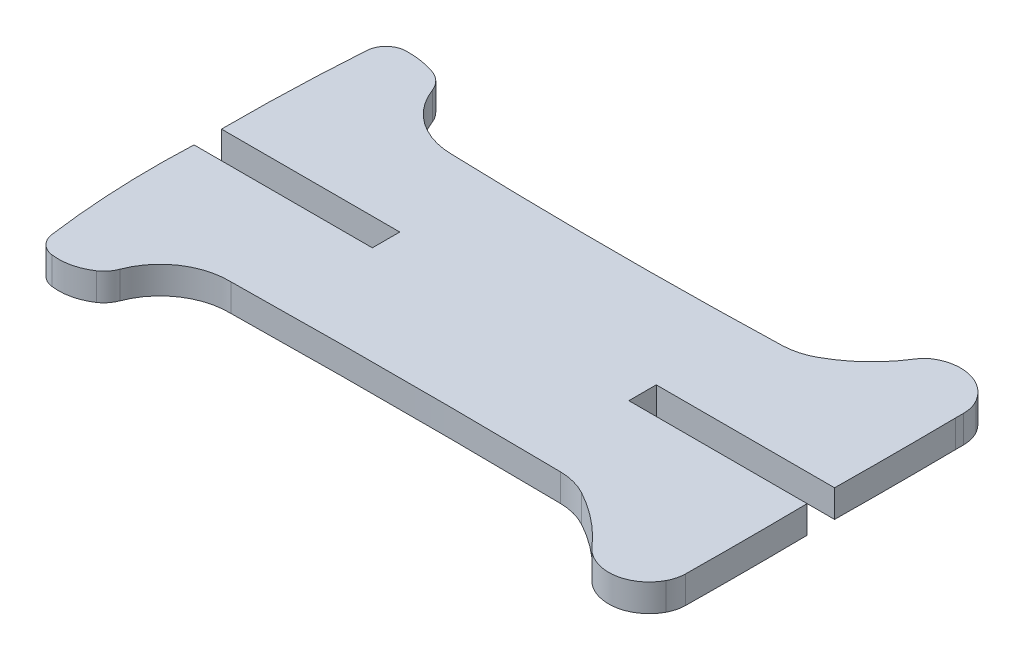
ISO-10303-21;
HEADER;
FILE_DESCRIPTION(('STEP AP214'),'2;1');
FILE_NAME('part.step','',(''),(''),'','','');
FILE_SCHEMA(('AUTOMOTIVE_DESIGN { 1 0 10303 214 1 1 1 1 }'));
ENDSEC;
DATA;
#1=APPLICATION_CONTEXT('core data for automotive mechanical design processes');
#2=APPLICATION_PROTOCOL_DEFINITION('international standard','automotive_design',2000,#1);
#3=PRODUCT_CONTEXT('',#1,'mechanical');
#4=PRODUCT('Part','Part','',(#3));
#5=PRODUCT_RELATED_PRODUCT_CATEGORY('part','',(#4));
#6=PRODUCT_DEFINITION_FORMATION('','',#4);
#7=PRODUCT_DEFINITION_CONTEXT('part definition',#1,'design');
#8=PRODUCT_DEFINITION('design','',#6,#7);
#9=PRODUCT_DEFINITION_SHAPE('','',#8);
#10=(LENGTH_UNIT() NAMED_UNIT(*) SI_UNIT(.MILLI.,.METRE.));
#11=(NAMED_UNIT(*) PLANE_ANGLE_UNIT() SI_UNIT($,.RADIAN.));
#12=(NAMED_UNIT(*) SI_UNIT($,.STERADIAN.) SOLID_ANGLE_UNIT());
#13=UNCERTAINTY_MEASURE_WITH_UNIT(LENGTH_MEASURE(1.E-05),#10,'distance_accuracy_value','');
#14=(GEOMETRIC_REPRESENTATION_CONTEXT(3) GLOBAL_UNCERTAINTY_ASSIGNED_CONTEXT((#13)) GLOBAL_UNIT_ASSIGNED_CONTEXT((#10,
#11,#12)) REPRESENTATION_CONTEXT('',''));
#15=CARTESIAN_POINT('',(0.,0.,0.));
#16=DIRECTION('',(0.,0.,1.));
#17=DIRECTION('',(1.,0.,0.));
#18=AXIS2_PLACEMENT_3D('',#15,#16,#17);
#19=CARTESIAN_POINT('',(224.331650718477,3.,-376.613762819195));
#20=DIRECTION('',(0.,-1.,0.));
#21=DIRECTION('',(0.,0.,-1.));
#22=AXIS2_PLACEMENT_3D('',#19,#20,#21);
#23=CYLINDRICAL_SURFACE('',#22,3.75000172829999);
#24=CARTESIAN_POINT('',(224.331650718477,0.,-376.613762819195));
#25=DIRECTION('',(0.,1.,0.));
#26=DIRECTION('',(0.,0.,1.));
#27=AXIS2_PLACEMENT_3D('',#24,#25,#26);
#28=CIRCLE('',#27,3.75000172829999);
#29=CARTESIAN_POINT('',(227.644000000028,0.,-374.855679999967));
#30=VERTEX_POINT('',#29);
#31=CARTESIAN_POINT('',(228.081419999959,0.,-376.572009999988));
#32=VERTEX_POINT('',#31);
#33=EDGE_CURVE('E261',#30,#32,#28,.T.);
#34=ORIENTED_EDGE('',*,*,#33,.T.);
#35=DIRECTION('',(0.,-1.,0.));
#36=VECTOR('',#35,1.);
#37=CARTESIAN_POINT('',(228.081419999959,3.,-376.572009999988));
#38=LINE('',#37,#36);
#39=CARTESIAN_POINT('',(228.081419999959,3.,-376.572009999988));
#40=VERTEX_POINT('',#39);
#41=EDGE_CURVE('E11',#40,#32,#38,.T.);
#42=ORIENTED_EDGE('',*,*,#41,.F.);
#43=CARTESIAN_POINT('',(224.331650718477,3.,-376.613762819195));
#44=DIRECTION('',(0.,1.,0.));
#45=DIRECTION('',(0.,0.,1.));
#46=AXIS2_PLACEMENT_3D('',#43,#44,#45);
#47=CIRCLE('',#46,3.75000172829999);
#48=CARTESIAN_POINT('',(227.644000000028,3.,-374.855679999967));
#49=VERTEX_POINT('',#48);
#50=EDGE_CURVE('E328',#49,#40,#47,.T.);
#51=ORIENTED_EDGE('',*,*,#50,.F.);
#52=DIRECTION('',(0.,-1.,0.));
#53=VECTOR('',#52,1.);
#54=CARTESIAN_POINT('',(227.644000000028,3.,-374.855679999967));
#55=LINE('',#54,#53);
#56=EDGE_CURVE('E257',#49,#30,#55,.T.);
#57=ORIENTED_EDGE('',*,*,#56,.T.);
#58=EDGE_LOOP('',(#34,#42,#51,#57));
#59=FACE_BOUND('',#58,.T.);
#60=ADVANCED_FACE('F34',(#59),#23,.T.);
#61=CARTESIAN_POINT('',(-346.105470004526,3.,-382.96579012445));
#62=DIRECTION('',(0.,-1.,0.));
#63=DIRECTION('',(0.,0.,-1.));
#64=AXIS2_PLACEMENT_3D('',#61,#62,#63);
#65=CYLINDRICAL_SURFACE('',#64,574.2224874361);
#66=CARTESIAN_POINT('',(-346.105470004526,0.,-382.96579012445));
#67=DIRECTION('',(0.,1.,0.));
#68=DIRECTION('',(0.,0.,1.));
#69=AXIS2_PLACEMENT_3D('',#66,#67,#68);
#70=CIRCLE('',#69,574.2224874361);
#71=CARTESIAN_POINT('',(228.075559999972,0.,-389.865779999461));
#72=VERTEX_POINT('',#71);
#73=EDGE_CURVE('E264',#32,#72,#70,.T.);
#74=ORIENTED_EDGE('',*,*,#73,.T.);
#75=DIRECTION('',(0.,-1.,0.));
#76=VECTOR('',#75,1.);
#77=CARTESIAN_POINT('',(228.075559999972,3.,-389.865779999461));
#78=LINE('',#77,#76);
#79=CARTESIAN_POINT('',(228.075559999972,3.,-389.865779999461));
#80=VERTEX_POINT('',#79);
#81=EDGE_CURVE('E42',#80,#72,#78,.T.);
#82=ORIENTED_EDGE('',*,*,#81,.F.);
#83=CARTESIAN_POINT('',(-346.105470004526,3.,-382.96579012445));
#84=DIRECTION('',(0.,1.,0.));
#85=DIRECTION('',(0.,0.,1.));
#86=AXIS2_PLACEMENT_3D('',#83,#84,#85);
#87=CIRCLE('',#86,574.2224874361);
#88=EDGE_CURVE('E155',#40,#80,#87,.T.);
#89=ORIENTED_EDGE('',*,*,#88,.F.);
#90=ORIENTED_EDGE('',*,*,#41,.T.);
#91=EDGE_LOOP('',(#74,#82,#89,#90));
#92=FACE_BOUND('',#91,.T.);
#93=ADVANCED_FACE('F488',(#92),#65,.T.);
#94=CARTESIAN_POINT('',(-288.964779950811,3.,-389.865779999461));
#95=DIRECTION('',(0.,0.,1.));
#96=DIRECTION('',(1.,0.,0.));
#97=AXIS2_PLACEMENT_3D('',#94,#95,#96);
#98=PLANE('',#97);
#99=DIRECTION('',(-1.,0.,0.));
#100=VECTOR('',#99,1.);
#101=CARTESIAN_POINT('',(-288.964779950811,0.,-389.865779999461));
#102=LINE('',#101,#100);
#103=CARTESIAN_POINT('',(208.575559999979,0.,-389.865779999461));
#104=VERTEX_POINT('',#103);
#105=EDGE_CURVE('E266',#72,#104,#102,.T.);
#106=ORIENTED_EDGE('',*,*,#105,.T.);
#107=DIRECTION('',(0.,-1.,0.));
#108=VECTOR('',#107,1.);
#109=CARTESIAN_POINT('',(208.575559999979,3.,-389.865779999461));
#110=LINE('',#109,#108);
#111=CARTESIAN_POINT('',(208.575559999979,3.,-389.865779999461));
#112=VERTEX_POINT('',#111);
#113=EDGE_CURVE('E394',#112,#104,#110,.T.);
#114=ORIENTED_EDGE('',*,*,#113,.F.);
#115=DIRECTION('',(-1.,0.,0.));
#116=VECTOR('',#115,1.);
#117=CARTESIAN_POINT('',(-288.964779950811,3.,-389.865779999461));
#118=LINE('',#117,#116);
#119=EDGE_CURVE('E402',#80,#112,#118,.T.);
#120=ORIENTED_EDGE('',*,*,#119,.F.);
#121=ORIENTED_EDGE('',*,*,#81,.T.);
#122=EDGE_LOOP('',(#106,#114,#120,#121));
#123=FACE_BOUND('',#122,.T.);
#124=ADVANCED_FACE('F400',(#123),#98,.F.);
#125=CARTESIAN_POINT('',(208.575560000121,3.,-409.999999996478));
#126=DIRECTION('',(-1.,0.,-7.07767178071345E-12));
#127=DIRECTION('',(-7.07767178071345E-12,0.,1.));
#128=AXIS2_PLACEMENT_3D('',#125,#126,#127);
#129=PLANE('',#128);
#130=DIRECTION('',(7.07767178071345E-12,0.,-1.));
#131=VECTOR('',#130,1.);
#132=CARTESIAN_POINT('',(208.575560000121,0.,-409.999999996478));
#133=LINE('',#132,#131);
#134=CARTESIAN_POINT('',(208.57556,0.,-392.86578));
#135=VERTEX_POINT('',#134);
#136=EDGE_CURVE('E268',#104,#135,#133,.T.);
#137=ORIENTED_EDGE('',*,*,#136,.T.);
#138=DIRECTION('',(0.,-1.,0.));
#139=VECTOR('',#138,1.);
#140=CARTESIAN_POINT('',(208.57556,3.,-392.86578));
#141=LINE('',#140,#139);
#142=CARTESIAN_POINT('',(208.57556,3.,-392.86578));
#143=VERTEX_POINT('',#142);
#144=EDGE_CURVE('E391',#143,#135,#141,.T.);
#145=ORIENTED_EDGE('',*,*,#144,.F.);
#146=DIRECTION('',(7.07767178071345E-12,0.,-1.));
#147=VECTOR('',#146,1.);
#148=CARTESIAN_POINT('',(208.575560000121,3.,-409.999999996478));
#149=LINE('',#148,#147);
#150=EDGE_CURVE('E420',#112,#143,#149,.T.);
#151=ORIENTED_EDGE('',*,*,#150,.F.);
#152=ORIENTED_EDGE('',*,*,#113,.T.);
#153=EDGE_LOOP('',(#137,#145,#151,#152));
#154=FACE_BOUND('',#153,.T.);
#155=ADVANCED_FACE('F411',(#154),#129,.F.);
#156=CARTESIAN_POINT('',(-288.964779950811,3.,-392.86578));
#157=DIRECTION('',(0.,0.,-1.));
#158=DIRECTION('',(-1.,0.,0.));
#159=AXIS2_PLACEMENT_3D('',#156,#157,#158);
#160=PLANE('',#159);
#161=DIRECTION('',(1.,0.,0.));
#162=VECTOR('',#161,1.);
#163=CARTESIAN_POINT('',(-288.964779950811,0.,-392.86578));
#164=LINE('',#163,#162);
#165=CARTESIAN_POINT('',(228.075559999956,0.,-392.86578));
#166=VERTEX_POINT('',#165);
#167=EDGE_CURVE('E270',#135,#166,#164,.T.);
#168=ORIENTED_EDGE('',*,*,#167,.T.);
#169=DIRECTION('',(0.,-1.,0.));
#170=VECTOR('',#169,1.);
#171=CARTESIAN_POINT('',(228.075559999956,3.,-392.86578));
#172=LINE('',#171,#170);
#173=CARTESIAN_POINT('',(228.075559999956,3.,-392.86578));
#174=VERTEX_POINT('',#173);
#175=EDGE_CURVE('E388',#174,#166,#172,.T.);
#176=ORIENTED_EDGE('',*,*,#175,.F.);
#177=DIRECTION('',(1.,0.,0.));
#178=VECTOR('',#177,1.);
#179=CARTESIAN_POINT('',(-288.964779950811,3.,-392.86578));
#180=LINE('',#179,#178);
#181=EDGE_CURVE('E417',#143,#174,#180,.T.);
#182=ORIENTED_EDGE('',*,*,#181,.F.);
#183=ORIENTED_EDGE('',*,*,#144,.T.);
#184=EDGE_LOOP('',(#168,#176,#182,#183));
#185=FACE_BOUND('',#184,.T.);
#186=ADVANCED_FACE('F415',(#185),#160,.F.);
#187=CARTESIAN_POINT('',(-374.417780000065,3.,-399.465780001946));
#188=DIRECTION('',(0.,-1.,0.));
#189=DIRECTION('',(0.,0.,-1.));
#190=AXIS2_PLACEMENT_3D('',#187,#188,#189);
#191=CYLINDRICAL_SURFACE('',#190,602.5294886928);
#192=CARTESIAN_POINT('',(-374.417780000065,0.,-399.465780001946));
#193=DIRECTION('',(0.,1.,0.));
#194=DIRECTION('',(0.,0.,1.));
#195=AXIS2_PLACEMENT_3D('',#192,#193,#194);
#196=CIRCLE('',#195,602.5294886928);
#197=CARTESIAN_POINT('',(228.07556,0.,-406.065779999915));
#198=VERTEX_POINT('',#197);
#199=EDGE_CURVE('E272',#166,#198,#196,.T.);
#200=ORIENTED_EDGE('',*,*,#199,.T.);
#201=DIRECTION('',(0.,-1.,0.));
#202=VECTOR('',#201,1.);
#203=CARTESIAN_POINT('',(228.07556,3.,-406.065779999915));
#204=LINE('',#203,#202);
#205=CARTESIAN_POINT('',(228.07556,3.,-406.065779999915));
#206=VERTEX_POINT('',#205);
#207=EDGE_CURVE('E385',#206,#198,#204,.T.);
#208=ORIENTED_EDGE('',*,*,#207,.F.);
#209=CARTESIAN_POINT('',(-374.417780000065,3.,-399.465780001946));
#210=DIRECTION('',(0.,1.,0.));
#211=DIRECTION('',(0.,0.,1.));
#212=AXIS2_PLACEMENT_3D('',#209,#210,#211);
#213=CIRCLE('',#212,602.5294886928);
#214=EDGE_CURVE('E419',#174,#206,#213,.T.);
#215=ORIENTED_EDGE('',*,*,#214,.F.);
#216=ORIENTED_EDGE('',*,*,#175,.T.);
#217=EDGE_LOOP('',(#200,#208,#215,#216));
#218=FACE_BOUND('',#217,.T.);
#219=ADVANCED_FACE('F501',(#218),#191,.T.);
#220=CARTESIAN_POINT('',(228.07556,3.,-410.));
#221=DIRECTION('',(-1.,0.,0.));
#222=DIRECTION('',(0.,0.,1.));
#223=AXIS2_PLACEMENT_3D('',#220,#221,#222);
#224=PLANE('',#223);
#225=DIRECTION('',(0.,0.,-1.));
#226=VECTOR('',#225,1.);
#227=CARTESIAN_POINT('',(228.07556,0.,-410.));
#228=LINE('',#227,#226);
#229=CARTESIAN_POINT('',(228.07556,0.,-406.9652));
#230=VERTEX_POINT('',#229);
#231=EDGE_CURVE('E274',#198,#230,#228,.T.);
#232=ORIENTED_EDGE('',*,*,#231,.T.);
#233=DIRECTION('',(0.,-1.,0.));
#234=VECTOR('',#233,1.);
#235=CARTESIAN_POINT('',(228.07556,3.,-406.9652));
#236=LINE('',#235,#234);
#237=CARTESIAN_POINT('',(228.07556,3.,-406.9652));
#238=VERTEX_POINT('',#237);
#239=EDGE_CURVE('E382',#238,#230,#236,.T.);
#240=ORIENTED_EDGE('',*,*,#239,.F.);
#241=DIRECTION('',(0.,0.,-1.));
#242=VECTOR('',#241,1.);
#243=CARTESIAN_POINT('',(228.07556,3.,-410.));
#244=LINE('',#243,#242);
#245=EDGE_CURVE('E422',#206,#238,#244,.T.);
#246=ORIENTED_EDGE('',*,*,#245,.F.);
#247=ORIENTED_EDGE('',*,*,#207,.T.);
#248=EDGE_LOOP('',(#232,#240,#246,#247));
#249=FACE_BOUND('',#248,.T.);
#250=ADVANCED_FACE('F504',(#249),#224,.F.);
#251=CARTESIAN_POINT('',(224.325562279609,3.,-406.965191728485));
#252=DIRECTION('',(0.,-1.,0.));
#253=DIRECTION('',(0.,0.,-1.));
#254=AXIS2_PLACEMENT_3D('',#251,#252,#253);
#255=CYLINDRICAL_SURFACE('',#254,3.74999772039999);
#256=CARTESIAN_POINT('',(224.325562279609,0.,-406.965191728485));
#257=DIRECTION('',(0.,1.,0.));
#258=DIRECTION('',(0.,0.,1.));
#259=AXIS2_PLACEMENT_3D('',#256,#257,#258);
#260=CIRCLE('',#259,3.74999772039999);
#261=CARTESIAN_POINT('',(227.546129999995,0.,-408.886239999979));
#262=VERTEX_POINT('',#261);
#263=EDGE_CURVE('E276',#230,#262,#260,.T.);
#264=ORIENTED_EDGE('',*,*,#263,.T.);
#265=DIRECTION('',(0.,-1.,0.));
#266=VECTOR('',#265,1.);
#267=CARTESIAN_POINT('',(227.546129999995,3.,-408.886239999979));
#268=LINE('',#267,#266);
#269=CARTESIAN_POINT('',(227.546129999995,3.,-408.886239999979));
#270=VERTEX_POINT('',#269);
#271=EDGE_CURVE('E379',#270,#262,#268,.T.);
#272=ORIENTED_EDGE('',*,*,#271,.F.);
#273=CARTESIAN_POINT('',(224.325562279609,3.,-406.965191728485));
#274=DIRECTION('',(0.,1.,0.));
#275=DIRECTION('',(0.,0.,1.));
#276=AXIS2_PLACEMENT_3D('',#273,#274,#275);
#277=CIRCLE('',#276,3.74999772039999);
#278=EDGE_CURVE('E428',#238,#270,#277,.T.);
#279=ORIENTED_EDGE('',*,*,#278,.F.);
#280=ORIENTED_EDGE('',*,*,#239,.T.);
#281=EDGE_LOOP('',(#264,#272,#279,#280));
#282=FACE_BOUND('',#281,.T.);
#283=ADVANCED_FACE('F508',(#282),#255,.T.);
#284=CARTESIAN_POINT('',(223.627115951546,3.,-406.548581034668));
#285=DIRECTION('',(0.,-1.,0.));
#286=DIRECTION('',(0.,0.,-1.));
#287=AXIS2_PLACEMENT_3D('',#284,#285,#286);
#288=CYLINDRICAL_SURFACE('',#287,4.56325766860001);
#289=CARTESIAN_POINT('',(223.627115951546,0.,-406.548581034668));
#290=DIRECTION('',(0.,1.,0.));
#291=DIRECTION('',(0.,0.,1.));
#292=AXIS2_PLACEMENT_3D('',#289,#290,#291);
#293=CIRCLE('',#292,4.56325766860001);
#294=CARTESIAN_POINT('',(221.31038000003,0.,-410.480000000003));
#295=VERTEX_POINT('',#294);
#296=EDGE_CURVE('E278',#262,#295,#293,.T.);
#297=ORIENTED_EDGE('',*,*,#296,.T.);
#298=DIRECTION('',(0.,-1.,0.));
#299=VECTOR('',#298,1.);
#300=CARTESIAN_POINT('',(221.31038000003,3.,-410.480000000003));
#301=LINE('',#300,#299);
#302=CARTESIAN_POINT('',(221.31038000003,3.,-410.480000000003));
#303=VERTEX_POINT('',#302);
#304=EDGE_CURVE('E376',#303,#295,#301,.T.);
#305=ORIENTED_EDGE('',*,*,#304,.F.);
#306=CARTESIAN_POINT('',(223.627115951546,3.,-406.548581034668));
#307=DIRECTION('',(0.,1.,0.));
#308=DIRECTION('',(0.,0.,1.));
#309=AXIS2_PLACEMENT_3D('',#306,#307,#308);
#310=CIRCLE('',#309,4.56325766860001);
#311=EDGE_CURVE('E430',#270,#303,#310,.T.);
#312=ORIENTED_EDGE('',*,*,#311,.F.);
#313=ORIENTED_EDGE('',*,*,#271,.T.);
#314=EDGE_LOOP('',(#297,#305,#312,#313));
#315=FACE_BOUND('',#314,.T.);
#316=ADVANCED_FACE('F512',(#315),#288,.T.);
#317=CARTESIAN_POINT('',(222.833473394324,3.,-407.895383308238));
#318=DIRECTION('',(0.,-1.,0.));
#319=DIRECTION('',(0.,0.,-1.));
#320=AXIS2_PLACEMENT_3D('',#317,#318,#319);
#321=CYLINDRICAL_SURFACE('',#320,3.00000948849998);
#322=CARTESIAN_POINT('',(222.833473394324,0.,-407.895383308238));
#323=DIRECTION('',(0.,1.,0.));
#324=DIRECTION('',(0.,0.,1.));
#325=AXIS2_PLACEMENT_3D('',#322,#323,#324);
#326=CIRCLE('',#325,3.00000948849998);
#327=CARTESIAN_POINT('',(220.288830000009,0.,-409.484359999968));
#328=VERTEX_POINT('',#327);
#329=EDGE_CURVE('E280',#295,#328,#326,.T.);
#330=ORIENTED_EDGE('',*,*,#329,.T.);
#331=DIRECTION('',(0.,-1.,0.));
#332=VECTOR('',#331,1.);
#333=CARTESIAN_POINT('',(220.288830000009,3.,-409.484359999968));
#334=LINE('',#333,#332);
#335=CARTESIAN_POINT('',(220.288830000009,3.,-409.484359999968));
#336=VERTEX_POINT('',#335);
#337=EDGE_CURVE('E374',#336,#328,#334,.T.);
#338=ORIENTED_EDGE('',*,*,#337,.F.);
#339=CARTESIAN_POINT('',(222.833473394324,3.,-407.895383308238));
#340=DIRECTION('',(0.,1.,0.));
#341=DIRECTION('',(0.,0.,1.));
#342=AXIS2_PLACEMENT_3D('',#339,#340,#341);
#343=CIRCLE('',#342,3.00000948849998);
#344=EDGE_CURVE('E432',#303,#336,#343,.T.);
#345=ORIENTED_EDGE('',*,*,#344,.F.);
#346=ORIENTED_EDGE('',*,*,#304,.T.);
#347=EDGE_LOOP('',(#330,#338,#345,#346));
#348=FACE_BOUND('',#347,.T.);
#349=ADVANCED_FACE('F516',(#348),#321,.T.);
#350=CARTESIAN_POINT('',(207.647242515142,3.,-417.378262933308));
#351=DIRECTION('',(0.,-1.,0.));
#352=DIRECTION('',(0.,0.,-1.));
#353=AXIS2_PLACEMENT_3D('',#350,#351,#352);
#354=CYLINDRICAL_SURFACE('',#353,14.9038061467019);
#355=CARTESIAN_POINT('',(207.647242515142,0.,-417.378262933308));
#356=DIRECTION('',(0.,1.,0.));
#357=DIRECTION('',(0.,0.,1.));
#358=AXIS2_PLACEMENT_3D('',#355,#356,#357);
#359=CIRCLE('',#358,14.9038061467019);
#360=CARTESIAN_POINT('',(214.802050000057,0.,-404.304159999941));
#361=VERTEX_POINT('',#360);
#362=EDGE_CURVE('E283',#361,#328,#359,.T.);
#363=ORIENTED_EDGE('',*,*,#362,.F.);
#364=DIRECTION('',(0.,-1.,0.));
#365=VECTOR('',#364,1.);
#366=CARTESIAN_POINT('',(214.802050000057,3.,-404.304159999941));
#367=LINE('',#366,#365);
#368=CARTESIAN_POINT('',(214.802050000057,3.,-404.304159999941));
#369=VERTEX_POINT('',#368);
#370=EDGE_CURVE('E372',#369,#361,#367,.T.);
#371=ORIENTED_EDGE('',*,*,#370,.F.);
#372=CARTESIAN_POINT('',(207.647242515142,3.,-417.378262933308));
#373=DIRECTION('',(0.,1.,0.));
#374=DIRECTION('',(0.,0.,1.));
#375=AXIS2_PLACEMENT_3D('',#372,#373,#374);
#376=CIRCLE('',#375,14.9038061467019);
#377=EDGE_CURVE('E434',#369,#336,#376,.T.);
#378=ORIENTED_EDGE('',*,*,#377,.T.);
#379=ORIENTED_EDGE('',*,*,#337,.T.);
#380=EDGE_LOOP('',(#363,#371,#378,#379));
#381=FACE_BOUND('',#380,.T.);
#382=ADVANCED_FACE('F520',(#381),#354,.F.);
#383=CARTESIAN_POINT('',(211.561597945263,3.,-410.225476723589));
#384=DIRECTION('',(0.,-1.,0.));
#385=DIRECTION('',(0.,0.,-1.));
#386=AXIS2_PLACEMENT_3D('',#383,#384,#385);
#387=CYLINDRICAL_SURFACE('',#386,6.75000157489995);
#388=CARTESIAN_POINT('',(211.561597945263,0.,-410.225476723589));
#389=DIRECTION('',(0.,1.,0.));
#390=DIRECTION('',(0.,0.,1.));
#391=AXIS2_PLACEMENT_3D('',#388,#389,#390);
#392=CIRCLE('',#391,6.75000157489995);
#393=CARTESIAN_POINT('',(211.764320000067,0.,-403.478520000025));
#394=VERTEX_POINT('',#393);
#395=EDGE_CURVE('E286',#394,#361,#392,.T.);
#396=ORIENTED_EDGE('',*,*,#395,.F.);
#397=DIRECTION('',(0.,-1.,0.));
#398=VECTOR('',#397,1.);
#399=CARTESIAN_POINT('',(211.764320000067,3.,-403.478520000025));
#400=LINE('',#399,#398);
#401=CARTESIAN_POINT('',(211.764320000067,3.,-403.478520000025));
#402=VERTEX_POINT('',#401);
#403=EDGE_CURVE('E370',#402,#394,#400,.T.);
#404=ORIENTED_EDGE('',*,*,#403,.F.);
#405=CARTESIAN_POINT('',(211.561597945263,3.,-410.225476723589));
#406=DIRECTION('',(0.,1.,0.));
#407=DIRECTION('',(0.,0.,1.));
#408=AXIS2_PLACEMENT_3D('',#405,#406,#407);
#409=CIRCLE('',#408,6.75000157489995);
#410=EDGE_CURVE('E437',#402,#369,#409,.T.);
#411=ORIENTED_EDGE('',*,*,#410,.T.);
#412=ORIENTED_EDGE('',*,*,#370,.T.);
#413=EDGE_LOOP('',(#396,#404,#411,#412));
#414=FACE_BOUND('',#413,.T.);
#415=ADVANCED_FACE('F524',(#414),#387,.F.);
#416=CARTESIAN_POINT('',(194.269467053019,3.,-985.787559838271));
#417=DIRECTION('',(0.,-1.,0.));
#418=DIRECTION('',(0.,0.,-1.));
#419=AXIS2_PLACEMENT_3D('',#416,#417,#418);
#420=CYLINDRICAL_SURFACE('',#419,582.5717876425);
#421=CARTESIAN_POINT('',(194.269467053019,0.,-985.787559838271));
#422=DIRECTION('',(0.,1.,0.));
#423=DIRECTION('',(0.,0.,1.));
#424=AXIS2_PLACEMENT_3D('',#421,#422,#423);
#425=CIRCLE('',#424,582.5717876425);
#426=CARTESIAN_POINT('',(175.575560000055,0.,-403.515779999961));
#427=VERTEX_POINT('',#426);
#428=EDGE_CURVE('E289',#427,#394,#425,.T.);
#429=ORIENTED_EDGE('',*,*,#428,.F.);
#430=DIRECTION('',(0.,-1.,0.));
#431=VECTOR('',#430,1.);
#432=CARTESIAN_POINT('',(175.575560000055,3.,-403.515779999961));
#433=LINE('',#432,#431);
#434=CARTESIAN_POINT('',(175.575560000055,3.,-403.515779999961));
#435=VERTEX_POINT('',#434);
#436=EDGE_CURVE('E368',#435,#427,#433,.T.);
#437=ORIENTED_EDGE('',*,*,#436,.F.);
#438=CARTESIAN_POINT('',(194.269467053019,3.,-985.787559838271));
#439=DIRECTION('',(0.,1.,0.));
#440=DIRECTION('',(0.,0.,1.));
#441=AXIS2_PLACEMENT_3D('',#438,#439,#440);
#442=CIRCLE('',#441,582.5717876425);
#443=EDGE_CURVE('E440',#435,#402,#442,.T.);
#444=ORIENTED_EDGE('',*,*,#443,.T.);
#445=ORIENTED_EDGE('',*,*,#403,.T.);
#446=EDGE_LOOP('',(#429,#437,#444,#445));
#447=FACE_BOUND('',#446,.T.);
#448=ADVANCED_FACE('F528',(#447),#420,.F.);
#449=CARTESIAN_POINT('',(175.619236054,3.,-411.1794327584));
#450=DIRECTION('',(0.,-1.,0.));
#451=DIRECTION('',(0.,0.,-1.));
#452=AXIS2_PLACEMENT_3D('',#449,#450,#451);
#453=CYLINDRICAL_SURFACE('',#452,7.66377721490017);
#454=CARTESIAN_POINT('',(175.619236054,0.,-411.1794327584));
#455=DIRECTION('',(0.,1.,0.));
#456=DIRECTION('',(0.,0.,1.));
#457=AXIS2_PLACEMENT_3D('',#454,#455,#456);
#458=CIRCLE('',#457,7.66377721490017);
#459=CARTESIAN_POINT('',(168.436880000052,0.,-408.505999999953));
#460=VERTEX_POINT('',#459);
#461=EDGE_CURVE('E292',#460,#427,#458,.T.);
#462=ORIENTED_EDGE('',*,*,#461,.F.);
#463=DIRECTION('',(0.,-1.,0.));
#464=VECTOR('',#463,1.);
#465=CARTESIAN_POINT('',(168.436880000052,3.,-408.505999999953));
#466=LINE('',#465,#464);
#467=CARTESIAN_POINT('',(168.436880000052,3.,-408.505999999953));
#468=VERTEX_POINT('',#467);
#469=EDGE_CURVE('E366',#468,#460,#466,.T.);
#470=ORIENTED_EDGE('',*,*,#469,.F.);
#471=CARTESIAN_POINT('',(175.619236054,3.,-411.1794327584));
#472=DIRECTION('',(0.,1.,0.));
#473=DIRECTION('',(0.,0.,1.));
#474=AXIS2_PLACEMENT_3D('',#471,#472,#473);
#475=CIRCLE('',#474,7.66377721490017);
#476=EDGE_CURVE('E443',#468,#435,#475,.T.);
#477=ORIENTED_EDGE('',*,*,#476,.T.);
#478=ORIENTED_EDGE('',*,*,#436,.T.);
#479=EDGE_LOOP('',(#462,#470,#477,#478));
#480=FACE_BOUND('',#479,.T.);
#481=ADVANCED_FACE('F532',(#480),#453,.F.);
#482=CARTESIAN_POINT('',(165.625334652336,3.,-407.459475483788));
#483=DIRECTION('',(0.,-1.,0.));
#484=DIRECTION('',(0.,0.,-1.));
#485=AXIS2_PLACEMENT_3D('',#482,#483,#484);
#486=CYLINDRICAL_SURFACE('',#485,3.00000013419999);
#487=CARTESIAN_POINT('',(165.625334652336,0.,-407.459475483788));
#488=DIRECTION('',(0.,1.,0.));
#489=DIRECTION('',(0.,0.,1.));
#490=AXIS2_PLACEMENT_3D('',#487,#488,#489);
#491=CIRCLE('',#490,3.00000013419999);
#492=CARTESIAN_POINT('',(166.587990000024,0.,-410.300829999994));
#493=VERTEX_POINT('',#492);
#494=EDGE_CURVE('E295',#460,#493,#491,.T.);
#495=ORIENTED_EDGE('',*,*,#494,.T.);
#496=DIRECTION('',(0.,-1.,0.));
#497=VECTOR('',#496,1.);
#498=CARTESIAN_POINT('',(166.587990000024,3.,-410.300829999994));
#499=LINE('',#498,#497);
#500=CARTESIAN_POINT('',(166.587990000024,3.,-410.300829999994));
#501=VERTEX_POINT('',#500);
#502=EDGE_CURVE('E363',#501,#493,#499,.T.);
#503=ORIENTED_EDGE('',*,*,#502,.F.);
#504=CARTESIAN_POINT('',(165.625334652336,3.,-407.459475483788));
#505=DIRECTION('',(0.,1.,0.));
#506=DIRECTION('',(0.,0.,1.));
#507=AXIS2_PLACEMENT_3D('',#504,#505,#506);
#508=CIRCLE('',#507,3.00000013419999);
#509=EDGE_CURVE('E446',#468,#501,#508,.T.);
#510=ORIENTED_EDGE('',*,*,#509,.F.);
#511=ORIENTED_EDGE('',*,*,#469,.T.);
#512=EDGE_LOOP('',(#495,#503,#510,#511));
#513=FACE_BOUND('',#512,.T.);
#514=ADVANCED_FACE('F536',(#513),#486,.T.);
#515=CARTESIAN_POINT('',(163.499598864966,3.,-401.185241701902));
#516=DIRECTION('',(0.,-1.,0.));
#517=DIRECTION('',(0.,0.,-1.));
#518=AXIS2_PLACEMENT_3D('',#515,#516,#517);
#519=CYLINDRICAL_SURFACE('',#518,9.624557643);
#520=CARTESIAN_POINT('',(163.499598864966,0.,-401.185241701902));
#521=DIRECTION('',(0.,1.,0.));
#522=DIRECTION('',(0.,0.,1.));
#523=AXIS2_PLACEMENT_3D('',#520,#521,#522);
#524=CIRCLE('',#523,9.624557643);
#525=CARTESIAN_POINT('',(163.275069999974,0.,-410.80717999999));
#526=VERTEX_POINT('',#525);
#527=EDGE_CURVE('E297',#493,#526,#524,.T.);
#528=ORIENTED_EDGE('',*,*,#527,.T.);
#529=DIRECTION('',(0.,-1.,0.));
#530=VECTOR('',#529,1.);
#531=CARTESIAN_POINT('',(163.275069999974,3.,-410.80717999999));
#532=LINE('',#531,#530);
#533=CARTESIAN_POINT('',(163.275069999974,3.,-410.80717999999));
#534=VERTEX_POINT('',#533);
#535=EDGE_CURVE('E360',#534,#526,#532,.T.);
#536=ORIENTED_EDGE('',*,*,#535,.F.);
#537=CARTESIAN_POINT('',(163.499598864966,3.,-401.185241701902));
#538=DIRECTION('',(0.,1.,0.));
#539=DIRECTION('',(0.,0.,1.));
#540=AXIS2_PLACEMENT_3D('',#537,#538,#539);
#541=CIRCLE('',#540,9.624557643);
#542=EDGE_CURVE('E448',#501,#534,#541,.T.);
#543=ORIENTED_EDGE('',*,*,#542,.F.);
#544=ORIENTED_EDGE('',*,*,#502,.T.);
#545=EDGE_LOOP('',(#528,#536,#543,#544));
#546=FACE_BOUND('',#545,.T.);
#547=ADVANCED_FACE('F540',(#546),#519,.T.);
#548=CARTESIAN_POINT('',(163.327560555405,3.,-408.557790530468));
#549=DIRECTION('',(0.,-1.,0.));
#550=DIRECTION('',(0.,0.,-1.));
#551=AXIS2_PLACEMENT_3D('',#548,#549,#550);
#552=CYLINDRICAL_SURFACE('',#551,2.25000183199998);
#553=CARTESIAN_POINT('',(163.327560555405,0.,-408.557790530468));
#554=DIRECTION('',(0.,1.,0.));
#555=DIRECTION('',(0.,0.,1.));
#556=AXIS2_PLACEMENT_3D('',#553,#554,#555);
#557=CIRCLE('',#556,2.25000183199998);
#558=CARTESIAN_POINT('',(161.082960000022,0.,-408.713599999951));
#559=VERTEX_POINT('',#558);
#560=EDGE_CURVE('E299',#526,#559,#557,.T.);
#561=ORIENTED_EDGE('',*,*,#560,.T.);
#562=DIRECTION('',(0.,-1.,0.));
#563=VECTOR('',#562,1.);
#564=CARTESIAN_POINT('',(161.082960000022,3.,-408.713599999951));
#565=LINE('',#564,#563);
#566=CARTESIAN_POINT('',(161.082960000022,3.,-408.713599999951));
#567=VERTEX_POINT('',#566);
#568=EDGE_CURVE('E357',#567,#559,#565,.T.);
#569=ORIENTED_EDGE('',*,*,#568,.F.);
#570=CARTESIAN_POINT('',(163.327560555405,3.,-408.557790530468));
#571=DIRECTION('',(0.,1.,0.));
#572=DIRECTION('',(0.,0.,1.));
#573=AXIS2_PLACEMENT_3D('',#570,#571,#572);
#574=CIRCLE('',#573,2.25000183199998);
#575=EDGE_CURVE('E450',#534,#567,#574,.T.);
#576=ORIENTED_EDGE('',*,*,#575,.F.);
#577=ORIENTED_EDGE('',*,*,#535,.T.);
#578=EDGE_LOOP('',(#561,#569,#576,#577));
#579=FACE_BOUND('',#578,.T.);
#580=ADVANCED_FACE('F544',(#579),#552,.T.);
#581=CARTESIAN_POINT('',(372.459701384803,3.,-394.040892022717));
#582=DIRECTION('',(0.,-1.,0.));
#583=DIRECTION('',(0.,0.,-1.));
#584=AXIS2_PLACEMENT_3D('',#581,#582,#583);
#585=CYLINDRICAL_SURFACE('',#584,211.885382124);
#586=CARTESIAN_POINT('',(372.459701384803,0.,-394.040892022717));
#587=DIRECTION('',(0.,1.,0.));
#588=DIRECTION('',(0.,0.,1.));
#589=AXIS2_PLACEMENT_3D('',#586,#587,#588);
#590=CIRCLE('',#589,211.885382124);
#591=CARTESIAN_POINT('',(160.57555999997,0.,-393.315779999912));
#592=VERTEX_POINT('',#591);
#593=EDGE_CURVE('E301',#559,#592,#590,.T.);
#594=ORIENTED_EDGE('',*,*,#593,.T.);
#595=DIRECTION('',(0.,-1.,0.));
#596=VECTOR('',#595,1.);
#597=CARTESIAN_POINT('',(160.57555999997,3.,-393.315779999912));
#598=LINE('',#597,#596);
#599=CARTESIAN_POINT('',(160.57555999997,3.,-393.315779999912));
#600=VERTEX_POINT('',#599);
#601=EDGE_CURVE('E354',#600,#592,#598,.T.);
#602=ORIENTED_EDGE('',*,*,#601,.F.);
#603=CARTESIAN_POINT('',(372.459701384803,3.,-394.040892022717));
#604=DIRECTION('',(0.,1.,0.));
#605=DIRECTION('',(0.,0.,1.));
#606=AXIS2_PLACEMENT_3D('',#603,#604,#605);
#607=CIRCLE('',#606,211.885382124);
#608=EDGE_CURVE('E452',#567,#600,#607,.T.);
#609=ORIENTED_EDGE('',*,*,#608,.F.);
#610=ORIENTED_EDGE('',*,*,#568,.T.);
#611=EDGE_LOOP('',(#594,#602,#609,#610));
#612=FACE_BOUND('',#611,.T.);
#613=ADVANCED_FACE('F548',(#612),#585,.T.);
#614=CARTESIAN_POINT('',(-288.964779950811,3.,-393.315779999912));
#615=DIRECTION('',(0.,0.,-1.));
#616=DIRECTION('',(-1.,0.,0.));
#617=AXIS2_PLACEMENT_3D('',#614,#615,#616);
#618=PLANE('',#617);
#619=DIRECTION('',(1.,0.,0.));
#620=VECTOR('',#619,1.);
#621=CARTESIAN_POINT('',(-288.964779950811,0.,-393.315779999912));
#622=LINE('',#621,#620);
#623=CARTESIAN_POINT('',(180.07556,0.,-393.315779999912));
#624=VERTEX_POINT('',#623);
#625=EDGE_CURVE('E303',#592,#624,#622,.T.);
#626=ORIENTED_EDGE('',*,*,#625,.T.);
#627=DIRECTION('',(0.,-1.,0.));
#628=VECTOR('',#627,1.);
#629=CARTESIAN_POINT('',(180.07556,3.,-393.315779999912));
#630=LINE('',#629,#628);
#631=CARTESIAN_POINT('',(180.07556,3.,-393.315779999912));
#632=VERTEX_POINT('',#631);
#633=EDGE_CURVE('E351',#632,#624,#630,.T.);
#634=ORIENTED_EDGE('',*,*,#633,.F.);
#635=DIRECTION('',(1.,0.,0.));
#636=VECTOR('',#635,1.);
#637=CARTESIAN_POINT('',(-288.964779950811,3.,-393.315779999912));
#638=LINE('',#637,#636);
#639=EDGE_CURVE('E454',#600,#632,#638,.T.);
#640=ORIENTED_EDGE('',*,*,#639,.F.);
#641=ORIENTED_EDGE('',*,*,#601,.T.);
#642=EDGE_LOOP('',(#626,#634,#640,#641));
#643=FACE_BOUND('',#642,.T.);
#644=ADVANCED_FACE('F552',(#643),#618,.F.);
#645=CARTESIAN_POINT('',(180.07556,3.,-410.));
#646=DIRECTION('',(1.,0.,0.));
#647=DIRECTION('',(0.,0.,-1.));
#648=AXIS2_PLACEMENT_3D('',#645,#646,#647);
#649=PLANE('',#648);
#650=DIRECTION('',(0.,0.,1.));
#651=VECTOR('',#650,1.);
#652=CARTESIAN_POINT('',(180.07556,0.,-410.));
#653=LINE('',#652,#651);
#654=CARTESIAN_POINT('',(180.07556,0.,-390.315779999912));
#655=VERTEX_POINT('',#654);
#656=EDGE_CURVE('E305',#624,#655,#653,.T.);
#657=ORIENTED_EDGE('',*,*,#656,.T.);
#658=DIRECTION('',(0.,-1.,0.));
#659=VECTOR('',#658,1.);
#660=CARTESIAN_POINT('',(180.07556,3.,-390.315779999912));
#661=LINE('',#660,#659);
#662=CARTESIAN_POINT('',(180.07556,3.,-390.315779999912));
#663=VERTEX_POINT('',#662);
#664=EDGE_CURVE('E348',#663,#655,#661,.T.);
#665=ORIENTED_EDGE('',*,*,#664,.F.);
#666=DIRECTION('',(0.,0.,1.));
#667=VECTOR('',#666,1.);
#668=CARTESIAN_POINT('',(180.07556,3.,-410.));
#669=LINE('',#668,#667);
#670=EDGE_CURVE('E456',#632,#663,#669,.T.);
#671=ORIENTED_EDGE('',*,*,#670,.F.);
#672=ORIENTED_EDGE('',*,*,#633,.T.);
#673=EDGE_LOOP('',(#657,#665,#671,#672));
#674=FACE_BOUND('',#673,.T.);
#675=ADVANCED_FACE('F556',(#674),#649,.F.);
#676=CARTESIAN_POINT('',(-288.964779950811,3.,-390.315779999912));
#677=DIRECTION('',(0.,0.,1.));
#678=DIRECTION('',(1.,0.,0.));
#679=AXIS2_PLACEMENT_3D('',#676,#677,#678);
#680=PLANE('',#679);
#681=DIRECTION('',(-1.,0.,0.));
#682=VECTOR('',#681,1.);
#683=CARTESIAN_POINT('',(-288.964779950811,0.,-390.315779999912));
#684=LINE('',#683,#682);
#685=CARTESIAN_POINT('',(160.57556,0.,-390.315779999912));
#686=VERTEX_POINT('',#685);
#687=EDGE_CURVE('E307',#655,#686,#684,.T.);
#688=ORIENTED_EDGE('',*,*,#687,.T.);
#689=DIRECTION('',(0.,-1.,0.));
#690=VECTOR('',#689,1.);
#691=CARTESIAN_POINT('',(160.57556,3.,-390.315779999912));
#692=LINE('',#691,#690);
#693=CARTESIAN_POINT('',(160.57556,3.,-390.315779999912));
#694=VERTEX_POINT('',#693);
#695=EDGE_CURVE('E345',#694,#686,#692,.T.);
#696=ORIENTED_EDGE('',*,*,#695,.F.);
#697=DIRECTION('',(-1.,0.,0.));
#698=VECTOR('',#697,1.);
#699=CARTESIAN_POINT('',(-288.964779950811,3.,-390.315779999912));
#700=LINE('',#699,#698);
#701=EDGE_CURVE('E458',#663,#694,#700,.T.);
#702=ORIENTED_EDGE('',*,*,#701,.F.);
#703=ORIENTED_EDGE('',*,*,#664,.T.);
#704=EDGE_LOOP('',(#688,#696,#702,#703));
#705=FACE_BOUND('',#704,.T.);
#706=ADVANCED_FACE('F560',(#705),#680,.F.);
#707=CARTESIAN_POINT('',(250.450160217355,3.,-386.098355024106));
#708=DIRECTION('',(0.,-1.,0.));
#709=DIRECTION('',(0.,0.,-1.));
#710=AXIS2_PLACEMENT_3D('',#707,#708,#709);
#711=CYLINDRICAL_SURFACE('',#710,89.9734985296);
#712=CARTESIAN_POINT('',(250.450160217355,0.,-386.098355024106));
#713=DIRECTION('',(0.,1.,0.));
#714=DIRECTION('',(0.,0.,1.));
#715=AXIS2_PLACEMENT_3D('',#712,#713,#714);
#716=CIRCLE('',#715,89.9734985296);
#717=CARTESIAN_POINT('',(161.285599999936,0.,-374.060429999824));
#718=VERTEX_POINT('',#717);
#719=EDGE_CURVE('E309',#686,#718,#716,.T.);
#720=ORIENTED_EDGE('',*,*,#719,.T.);
#721=DIRECTION('',(0.,-1.,0.));
#722=VECTOR('',#721,1.);
#723=CARTESIAN_POINT('',(161.285599999936,3.,-374.060429999824));
#724=LINE('',#723,#722);
#725=CARTESIAN_POINT('',(161.285599999936,3.,-374.060429999824));
#726=VERTEX_POINT('',#725);
#727=EDGE_CURVE('E342',#726,#718,#724,.T.);
#728=ORIENTED_EDGE('',*,*,#727,.F.);
#729=CARTESIAN_POINT('',(250.450160217355,3.,-386.098355024106));
#730=DIRECTION('',(0.,1.,0.));
#731=DIRECTION('',(0.,0.,1.));
#732=AXIS2_PLACEMENT_3D('',#729,#730,#731);
#733=CIRCLE('',#732,89.9734985296);
#734=EDGE_CURVE('E460',#694,#726,#733,.T.);
#735=ORIENTED_EDGE('',*,*,#734,.F.);
#736=ORIENTED_EDGE('',*,*,#695,.T.);
#737=EDGE_LOOP('',(#720,#728,#735,#736));
#738=FACE_BOUND('',#737,.T.);
#739=ADVANCED_FACE('F564',(#738),#711,.T.);
#740=CARTESIAN_POINT('',(163.51537124888,3.,-374.361468758928));
#741=DIRECTION('',(0.,-1.,0.));
#742=DIRECTION('',(0.,0.,-1.));
#743=AXIS2_PLACEMENT_3D('',#740,#741,#742);
#744=CYLINDRICAL_SURFACE('',#743,2.25000092379998);
#745=CARTESIAN_POINT('',(163.51537124888,0.,-374.361468758928));
#746=DIRECTION('',(0.,1.,0.));
#747=DIRECTION('',(0.,0.,1.));
#748=AXIS2_PLACEMENT_3D('',#745,#746,#747);
#749=CIRCLE('',#748,2.25000092379998);
#750=CARTESIAN_POINT('',(163.228660000049,0.,-372.129809999867));
#751=VERTEX_POINT('',#750);
#752=EDGE_CURVE('E311',#718,#751,#749,.T.);
#753=ORIENTED_EDGE('',*,*,#752,.T.);
#754=DIRECTION('',(0.,-1.,0.));
#755=VECTOR('',#754,1.);
#756=CARTESIAN_POINT('',(163.228660000049,3.,-372.129809999867));
#757=LINE('',#756,#755);
#758=CARTESIAN_POINT('',(163.228660000049,3.,-372.129809999867));
#759=VERTEX_POINT('',#758);
#760=EDGE_CURVE('E339',#759,#751,#757,.T.);
#761=ORIENTED_EDGE('',*,*,#760,.F.);
#762=CARTESIAN_POINT('',(163.51537124888,3.,-374.361468758928));
#763=DIRECTION('',(0.,1.,0.));
#764=DIRECTION('',(0.,0.,1.));
#765=AXIS2_PLACEMENT_3D('',#762,#763,#764);
#766=CIRCLE('',#765,2.25000092379998);
#767=EDGE_CURVE('E462',#726,#759,#766,.T.);
#768=ORIENTED_EDGE('',*,*,#767,.F.);
#769=ORIENTED_EDGE('',*,*,#727,.T.);
#770=EDGE_LOOP('',(#753,#761,#768,#769));
#771=FACE_BOUND('',#770,.T.);
#772=ADVANCED_FACE('F568',(#771),#744,.T.);
#773=CARTESIAN_POINT('',(163.961398893806,3.,-377.833307398516));
#774=DIRECTION('',(0.,-1.,0.));
#775=DIRECTION('',(0.,0.,-1.));
#776=AXIS2_PLACEMENT_3D('',#773,#774,#775);
#777=CYLINDRICAL_SURFACE('',#776,5.75037293249995);
#778=CARTESIAN_POINT('',(163.961398893806,0.,-377.833307398516));
#779=DIRECTION('',(0.,1.,0.));
#780=DIRECTION('',(0.,0.,1.));
#781=AXIS2_PLACEMENT_3D('',#778,#779,#780);
#782=CIRCLE('',#781,5.75037293249995);
#783=CARTESIAN_POINT('',(167.150789999964,0.,-373.048479999875));
#784=VERTEX_POINT('',#783);
#785=EDGE_CURVE('E313',#751,#784,#782,.T.);
#786=ORIENTED_EDGE('',*,*,#785,.T.);
#787=DIRECTION('',(0.,-1.,0.));
#788=VECTOR('',#787,1.);
#789=CARTESIAN_POINT('',(167.150789999964,3.,-373.048479999875));
#790=LINE('',#789,#788);
#791=CARTESIAN_POINT('',(167.150789999964,3.,-373.048479999875));
#792=VERTEX_POINT('',#791);
#793=EDGE_CURVE('E336',#792,#784,#790,.T.);
#794=ORIENTED_EDGE('',*,*,#793,.F.);
#795=CARTESIAN_POINT('',(163.961398893806,3.,-377.833307398516));
#796=DIRECTION('',(0.,1.,0.));
#797=DIRECTION('',(0.,0.,1.));
#798=AXIS2_PLACEMENT_3D('',#795,#796,#797);
#799=CIRCLE('',#798,5.75037293249995);
#800=EDGE_CURVE('E464',#759,#792,#799,.T.);
#801=ORIENTED_EDGE('',*,*,#800,.F.);
#802=ORIENTED_EDGE('',*,*,#760,.T.);
#803=EDGE_LOOP('',(#786,#794,#801,#802));
#804=FACE_BOUND('',#803,.T.);
#805=ADVANCED_FACE('F572',(#804),#777,.T.);
#806=CARTESIAN_POINT('',(165.486883095255,3.,-375.544753890194));
#807=DIRECTION('',(0.,-1.,0.));
#808=DIRECTION('',(0.,0.,-1.));
#809=AXIS2_PLACEMENT_3D('',#806,#807,#808);
#810=CYLINDRICAL_SURFACE('',#809,2.99999492049998);
#811=CARTESIAN_POINT('',(165.486883095255,0.,-375.544753890194));
#812=DIRECTION('',(0.,1.,0.));
#813=DIRECTION('',(0.,0.,1.));
#814=AXIS2_PLACEMENT_3D('',#811,#812,#813);
#815=CIRCLE('',#814,2.99999492049998);
#816=CARTESIAN_POINT('',(168.293209999952,0.,-374.484329999951));
#817=VERTEX_POINT('',#816);
#818=EDGE_CURVE('E315',#784,#817,#815,.T.);
#819=ORIENTED_EDGE('',*,*,#818,.T.);
#820=DIRECTION('',(0.,-1.,0.));
#821=VECTOR('',#820,1.);
#822=CARTESIAN_POINT('',(168.293209999952,3.,-374.484329999951));
#823=LINE('',#822,#821);
#824=CARTESIAN_POINT('',(168.293209999952,3.,-374.484329999951));
#825=VERTEX_POINT('',#824);
#826=EDGE_CURVE('E334',#825,#817,#823,.T.);
#827=ORIENTED_EDGE('',*,*,#826,.F.);
#828=CARTESIAN_POINT('',(165.486883095255,3.,-375.544753890194));
#829=DIRECTION('',(0.,1.,0.));
#830=DIRECTION('',(0.,0.,1.));
#831=AXIS2_PLACEMENT_3D('',#828,#829,#830);
#832=CIRCLE('',#831,2.99999492049998);
#833=EDGE_CURVE('E466',#792,#825,#832,.T.);
#834=ORIENTED_EDGE('',*,*,#833,.F.);
#835=ORIENTED_EDGE('',*,*,#793,.T.);
#836=EDGE_LOOP('',(#819,#827,#834,#835));
#837=FACE_BOUND('',#836,.T.);
#838=ADVANCED_FACE('F576',(#837),#810,.T.);
#839=CARTESIAN_POINT('',(175.360494236605,3.,-371.813842839791));
#840=DIRECTION('',(0.,-1.,0.));
#841=DIRECTION('',(0.,0.,-1.));
#842=AXIS2_PLACEMENT_3D('',#839,#840,#841);
#843=CYLINDRICAL_SURFACE('',#842,7.55499888512329);
#844=CARTESIAN_POINT('',(175.360494236605,0.,-371.813842839791));
#845=DIRECTION('',(0.,1.,0.));
#846=DIRECTION('',(0.,0.,1.));
#847=AXIS2_PLACEMENT_3D('',#844,#845,#846);
#848=CIRCLE('',#847,7.55499888512329);
#849=CARTESIAN_POINT('',(175.575560000757,0.,-379.365779999971));
#850=VERTEX_POINT('',#849);
#851=EDGE_CURVE('E318',#850,#817,#848,.T.);
#852=ORIENTED_EDGE('',*,*,#851,.F.);
#853=DIRECTION('',(0.,-1.,0.));
#854=VECTOR('',#853,1.);
#855=CARTESIAN_POINT('',(175.575560000757,3.,-379.365779999971));
#856=LINE('',#855,#854);
#857=CARTESIAN_POINT('',(175.575560000757,3.,-379.365779999971));
#858=VERTEX_POINT('',#857);
#859=EDGE_CURVE('E332',#858,#850,#856,.T.);
#860=ORIENTED_EDGE('',*,*,#859,.F.);
#861=CARTESIAN_POINT('',(175.360494236605,3.,-371.813842839791));
#862=DIRECTION('',(0.,1.,0.));
#863=DIRECTION('',(0.,0.,1.));
#864=AXIS2_PLACEMENT_3D('',#861,#862,#863);
#865=CIRCLE('',#864,7.55499888512329);
#866=EDGE_CURVE('E468',#858,#825,#865,.T.);
#867=ORIENTED_EDGE('',*,*,#866,.T.);
#868=ORIENTED_EDGE('',*,*,#826,.T.);
#869=EDGE_LOOP('',(#852,#860,#867,#868));
#870=FACE_BOUND('',#869,.T.);
#871=ADVANCED_FACE('F580',(#870),#843,.F.);
#872=CARTESIAN_POINT('',(194.32538458156,3.,792.434220112458));
#873=DIRECTION('',(0.,-1.,0.));
#874=DIRECTION('',(0.,0.,-1.));
#875=AXIS2_PLACEMENT_3D('',#872,#873,#874);
#876=CYLINDRICAL_SURFACE('',#875,1171.9499973059);
#877=CARTESIAN_POINT('',(194.32538458156,0.,792.434220112458));
#878=DIRECTION('',(0.,1.,0.));
#879=DIRECTION('',(0.,0.,1.));
#880=AXIS2_PLACEMENT_3D('',#877,#878,#879);
#881=CIRCLE('',#880,1171.9499973059);
#882=CARTESIAN_POINT('',(211.573919999937,0.,-379.388839999955));
#883=VERTEX_POINT('',#882);
#884=EDGE_CURVE('E321',#883,#850,#881,.T.);
#885=ORIENTED_EDGE('',*,*,#884,.F.);
#886=DIRECTION('',(0.,-1.,0.));
#887=VECTOR('',#886,1.);
#888=CARTESIAN_POINT('',(211.573919999937,3.,-379.388839999955));
#889=LINE('',#888,#887);
#890=CARTESIAN_POINT('',(211.573919999937,3.,-379.388839999955));
#891=VERTEX_POINT('',#890);
#892=EDGE_CURVE('E246',#891,#883,#889,.T.);
#893=ORIENTED_EDGE('',*,*,#892,.F.);
#894=CARTESIAN_POINT('',(194.32538458156,3.,792.434220112458));
#895=DIRECTION('',(0.,1.,0.));
#896=DIRECTION('',(0.,0.,1.));
#897=AXIS2_PLACEMENT_3D('',#894,#895,#896);
#898=CIRCLE('',#897,1171.9499973059);
#899=EDGE_CURVE('E253',#891,#858,#898,.T.);
#900=ORIENTED_EDGE('',*,*,#899,.T.);
#901=ORIENTED_EDGE('',*,*,#859,.T.);
#902=EDGE_LOOP('',(#885,#893,#900,#901));
#903=FACE_BOUND('',#902,.T.);
#904=ADVANCED_FACE('F472',(#903),#876,.F.);
#905=CARTESIAN_POINT('',(211.474574671746,3.,-372.639568771543));
#906=DIRECTION('',(0.,-1.,0.));
#907=DIRECTION('',(0.,0.,-1.));
#908=AXIS2_PLACEMENT_3D('',#905,#906,#907);
#909=CYLINDRICAL_SURFACE('',#908,6.75000234140009);
#910=CARTESIAN_POINT('',(211.474574671746,0.,-372.639568771543));
#911=DIRECTION('',(0.,1.,0.));
#912=DIRECTION('',(0.,0.,1.));
#913=AXIS2_PLACEMENT_3D('',#910,#911,#912);
#914=CIRCLE('',#913,6.75000234140009);
#915=CARTESIAN_POINT('',(214.707919999954,0.,-378.564769999979));
#916=VERTEX_POINT('',#915);
#917=EDGE_CURVE('E241',#916,#883,#914,.T.);
#918=ORIENTED_EDGE('',*,*,#917,.F.);
#919=DIRECTION('',(0.,-1.,0.));
#920=VECTOR('',#919,1.);
#921=CARTESIAN_POINT('',(214.707919999954,3.,-378.564769999979));
#922=LINE('',#921,#920);
#923=CARTESIAN_POINT('',(214.707919999954,3.,-378.564769999979));
#924=VERTEX_POINT('',#923);
#925=EDGE_CURVE('E236',#924,#916,#922,.T.);
#926=ORIENTED_EDGE('',*,*,#925,.F.);
#927=CARTESIAN_POINT('',(211.474574671746,3.,-372.639568771543));
#928=DIRECTION('',(0.,1.,0.));
#929=DIRECTION('',(0.,0.,1.));
#930=AXIS2_PLACEMENT_3D('',#927,#928,#929);
#931=CIRCLE('',#930,6.75000234140009);
#932=EDGE_CURVE('E239',#924,#891,#931,.T.);
#933=ORIENTED_EDGE('',*,*,#932,.T.);
#934=ORIENTED_EDGE('',*,*,#892,.T.);
#935=EDGE_LOOP('',(#918,#926,#933,#934));
#936=FACE_BOUND('',#935,.T.);
#937=ADVANCED_FACE('F238',(#936),#909,.F.);
#938=CARTESIAN_POINT('',(204.658257592879,3.,-360.148463854644));
#939=DIRECTION('',(0.,-1.,0.));
#940=DIRECTION('',(0.,0.,-1.));
#941=AXIS2_PLACEMENT_3D('',#938,#939,#940);
#942=CYLINDRICAL_SURFACE('',#941,20.979896247);
#943=CARTESIAN_POINT('',(204.658257592879,0.,-360.148463854644));
#944=DIRECTION('',(0.,1.,0.));
#945=DIRECTION('',(0.,0.,1.));
#946=AXIS2_PLACEMENT_3D('',#943,#944,#945);
#947=CIRCLE('',#946,20.979896247);
#948=CARTESIAN_POINT('',(220.575559999957,0.,-373.815779999978));
#949=VERTEX_POINT('',#948);
#950=EDGE_CURVE('E325',#949,#916,#947,.T.);
#951=ORIENTED_EDGE('',*,*,#950,.F.);
#952=DIRECTION('',(0.,-1.,0.));
#953=VECTOR('',#952,1.);
#954=CARTESIAN_POINT('',(220.575559999957,3.,-373.815779999978));
#955=LINE('',#954,#953);
#956=CARTESIAN_POINT('',(220.575559999957,3.,-373.815779999978));
#957=VERTEX_POINT('',#956);
#958=EDGE_CURVE('E144',#957,#949,#955,.T.);
#959=ORIENTED_EDGE('',*,*,#958,.F.);
#960=CARTESIAN_POINT('',(204.658257592879,3.,-360.148463854644));
#961=DIRECTION('',(0.,1.,0.));
#962=DIRECTION('',(0.,0.,1.));
#963=AXIS2_PLACEMENT_3D('',#960,#961,#962);
#964=CIRCLE('',#963,20.979896247);
#965=EDGE_CURVE('E250',#957,#924,#964,.T.);
#966=ORIENTED_EDGE('',*,*,#965,.T.);
#967=ORIENTED_EDGE('',*,*,#925,.T.);
#968=EDGE_LOOP('',(#951,#959,#966,#967));
#969=FACE_BOUND('',#968,.T.);
#970=ADVANCED_FACE('F255',(#969),#942,.F.);
#971=CARTESIAN_POINT('',(223.727459591879,3.,-376.934449939945));
#972=DIRECTION('',(0.,-1.,0.));
#973=DIRECTION('',(0.,0.,-1.));
#974=AXIS2_PLACEMENT_3D('',#971,#972,#973);
#975=CYLINDRICAL_SURFACE('',#974,4.43402449609999);
#976=CARTESIAN_POINT('',(223.727459591879,0.,-376.934449939945));
#977=DIRECTION('',(0.,1.,0.));
#978=DIRECTION('',(0.,0.,1.));
#979=AXIS2_PLACEMENT_3D('',#976,#977,#978);
#980=CIRCLE('',#979,4.43402449609999);
#981=EDGE_CURVE('E147',#949,#30,#980,.T.);
#982=ORIENTED_EDGE('',*,*,#981,.T.);
#983=ORIENTED_EDGE('',*,*,#56,.F.);
#984=CARTESIAN_POINT('',(223.727459591879,3.,-376.934449939945));
#985=DIRECTION('',(0.,1.,0.));
#986=DIRECTION('',(0.,0.,1.));
#987=AXIS2_PLACEMENT_3D('',#984,#985,#986);
#988=CIRCLE('',#987,4.43402449609999);
#989=EDGE_CURVE('E50',#957,#49,#988,.T.);
#990=ORIENTED_EDGE('',*,*,#989,.F.);
#991=ORIENTED_EDGE('',*,*,#958,.T.);
#992=EDGE_LOOP('',(#982,#983,#990,#991));
#993=FACE_BOUND('',#992,.T.);
#994=ADVANCED_FACE('F477',(#993),#975,.T.);
#995=CARTESIAN_POINT('',(-288.964779950811,3.,-410.));
#996=DIRECTION('',(0.,1.,0.));
#997=DIRECTION('',(0.,0.,1.));
#998=AXIS2_PLACEMENT_3D('',#995,#996,#997);
#999=PLANE('',#998);
#1000=ORIENTED_EDGE('',*,*,#50,.T.);
#1001=ORIENTED_EDGE('',*,*,#88,.T.);
#1002=ORIENTED_EDGE('',*,*,#119,.T.);
#1003=ORIENTED_EDGE('',*,*,#150,.T.);
#1004=ORIENTED_EDGE('',*,*,#181,.T.);
#1005=ORIENTED_EDGE('',*,*,#214,.T.);
#1006=ORIENTED_EDGE('',*,*,#245,.T.);
#1007=ORIENTED_EDGE('',*,*,#278,.T.);
#1008=ORIENTED_EDGE('',*,*,#311,.T.);
#1009=ORIENTED_EDGE('',*,*,#344,.T.);
#1010=ORIENTED_EDGE('',*,*,#377,.F.);
#1011=ORIENTED_EDGE('',*,*,#410,.F.);
#1012=ORIENTED_EDGE('',*,*,#443,.F.);
#1013=ORIENTED_EDGE('',*,*,#476,.F.);
#1014=ORIENTED_EDGE('',*,*,#509,.T.);
#1015=ORIENTED_EDGE('',*,*,#542,.T.);
#1016=ORIENTED_EDGE('',*,*,#575,.T.);
#1017=ORIENTED_EDGE('',*,*,#608,.T.);
#1018=ORIENTED_EDGE('',*,*,#639,.T.);
#1019=ORIENTED_EDGE('',*,*,#670,.T.);
#1020=ORIENTED_EDGE('',*,*,#701,.T.);
#1021=ORIENTED_EDGE('',*,*,#734,.T.);
#1022=ORIENTED_EDGE('',*,*,#767,.T.);
#1023=ORIENTED_EDGE('',*,*,#800,.T.);
#1024=ORIENTED_EDGE('',*,*,#833,.T.);
#1025=ORIENTED_EDGE('',*,*,#866,.F.);
#1026=ORIENTED_EDGE('',*,*,#899,.F.);
#1027=ORIENTED_EDGE('',*,*,#932,.F.);
#1028=ORIENTED_EDGE('',*,*,#965,.F.);
#1029=ORIENTED_EDGE('',*,*,#989,.T.);
#1030=EDGE_LOOP('',(#1000,#1001,#1002,#1003,#1004,#1005,#1006,#1007,#1008,#1009,#1010,#1011,
#1012,#1013,#1014,#1015,#1016,#1017,#1018,#1019,#1020,#1021,#1022,#1023,#1024,#1025,#1026,#1027,
#1028,#1029));
#1031=FACE_BOUND('',#1030,.T.);
#1032=ADVANCED_FACE('F249',(#1031),#999,.T.);
#1033=CARTESIAN_POINT('',(-288.964779950811,0.,-410.));
#1034=DIRECTION('',(0.,1.,0.));
#1035=DIRECTION('',(0.,0.,1.));
#1036=AXIS2_PLACEMENT_3D('',#1033,#1034,#1035);
#1037=PLANE('',#1036);
#1038=ORIENTED_EDGE('',*,*,#33,.F.);
#1039=ORIENTED_EDGE('',*,*,#981,.F.);
#1040=ORIENTED_EDGE('',*,*,#950,.T.);
#1041=ORIENTED_EDGE('',*,*,#917,.T.);
#1042=ORIENTED_EDGE('',*,*,#884,.T.);
#1043=ORIENTED_EDGE('',*,*,#851,.T.);
#1044=ORIENTED_EDGE('',*,*,#818,.F.);
#1045=ORIENTED_EDGE('',*,*,#785,.F.);
#1046=ORIENTED_EDGE('',*,*,#752,.F.);
#1047=ORIENTED_EDGE('',*,*,#719,.F.);
#1048=ORIENTED_EDGE('',*,*,#687,.F.);
#1049=ORIENTED_EDGE('',*,*,#656,.F.);
#1050=ORIENTED_EDGE('',*,*,#625,.F.);
#1051=ORIENTED_EDGE('',*,*,#593,.F.);
#1052=ORIENTED_EDGE('',*,*,#560,.F.);
#1053=ORIENTED_EDGE('',*,*,#527,.F.);
#1054=ORIENTED_EDGE('',*,*,#494,.F.);
#1055=ORIENTED_EDGE('',*,*,#461,.T.);
#1056=ORIENTED_EDGE('',*,*,#428,.T.);
#1057=ORIENTED_EDGE('',*,*,#395,.T.);
#1058=ORIENTED_EDGE('',*,*,#362,.T.);
#1059=ORIENTED_EDGE('',*,*,#329,.F.);
#1060=ORIENTED_EDGE('',*,*,#296,.F.);
#1061=ORIENTED_EDGE('',*,*,#263,.F.);
#1062=ORIENTED_EDGE('',*,*,#231,.F.);
#1063=ORIENTED_EDGE('',*,*,#199,.F.);
#1064=ORIENTED_EDGE('',*,*,#167,.F.);
#1065=ORIENTED_EDGE('',*,*,#136,.F.);
#1066=ORIENTED_EDGE('',*,*,#105,.F.);
#1067=ORIENTED_EDGE('',*,*,#73,.F.);
#1068=EDGE_LOOP('',(#1038,#1039,#1040,#1041,#1042,#1043,#1044,#1045,#1046,#1047,#1048,#1049,
#1050,#1051,#1052,#1053,#1054,#1055,#1056,#1057,#1058,#1059,#1060,#1061,#1062,#1063,#1064,#1065,
#1066,#1067));
#1069=FACE_BOUND('',#1068,.T.);
#1070=ADVANCED_FACE('F406',(#1069),#1037,.F.);
#1071=CLOSED_SHELL('',(#60,#93,#124,#155,#186,#219,#250,#283,#316,#349,#382,#415,#448,#481,#514,
#547,#580,#613,#644,#675,#706,#739,#772,#805,#838,#871,#904,#937,#970,#994,#1032,#1070));
#1072=MANIFOLD_SOLID_BREP('B2',#1071);
#1073=ADVANCED_BREP_SHAPE_REPRESENTATION('',(#18,#1072),#14);
#1074=SHAPE_DEFINITION_REPRESENTATION(#9,#1073);
ENDSEC;
END-ISO-10303-21;
